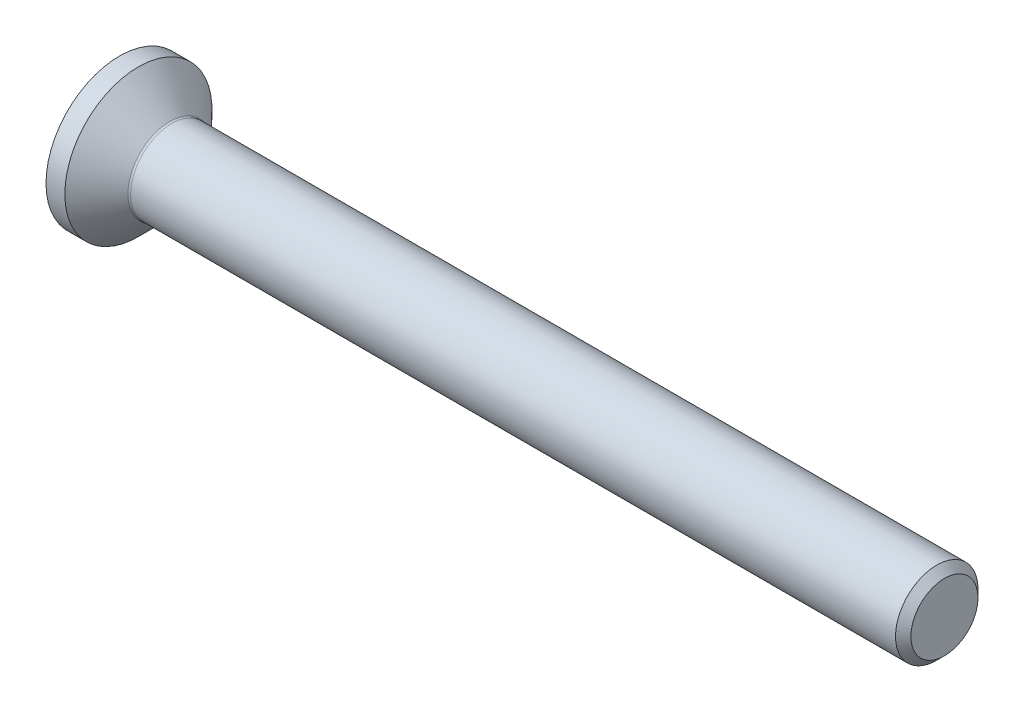
ISO-10303-21;
HEADER;
FILE_DESCRIPTION(('STEP AP214'),'2;1');
FILE_NAME('part.step','',(''),(''),'','','');
FILE_SCHEMA(('AUTOMOTIVE_DESIGN { 1 0 10303 214 1 1 1 1 }'));
ENDSEC;
DATA;
#1=APPLICATION_CONTEXT('core data for automotive mechanical design processes');
#2=APPLICATION_PROTOCOL_DEFINITION('international standard','automotive_design',2000,#1);
#3=PRODUCT_CONTEXT('',#1,'mechanical');
#4=PRODUCT('Part','Part','',(#3));
#5=PRODUCT_RELATED_PRODUCT_CATEGORY('part','',(#4));
#6=PRODUCT_DEFINITION_FORMATION('','',#4);
#7=PRODUCT_DEFINITION_CONTEXT('part definition',#1,'design');
#8=PRODUCT_DEFINITION('design','',#6,#7);
#9=PRODUCT_DEFINITION_SHAPE('','',#8);
#10=(LENGTH_UNIT() NAMED_UNIT(*) SI_UNIT(.MILLI.,.METRE.));
#11=(NAMED_UNIT(*) PLANE_ANGLE_UNIT() SI_UNIT($,.RADIAN.));
#12=(NAMED_UNIT(*) SI_UNIT($,.STERADIAN.) SOLID_ANGLE_UNIT());
#13=UNCERTAINTY_MEASURE_WITH_UNIT(LENGTH_MEASURE(1.E-05),#10,'distance_accuracy_value','');
#14=(GEOMETRIC_REPRESENTATION_CONTEXT(3) GLOBAL_UNCERTAINTY_ASSIGNED_CONTEXT((#13)) GLOBAL_UNIT_ASSIGNED_CONTEXT((#10,
#11,#12)) REPRESENTATION_CONTEXT('',''));
#15=CARTESIAN_POINT('',(0.,0.,0.));
#16=DIRECTION('',(0.,0.,1.));
#17=DIRECTION('',(1.,0.,0.));
#18=AXIS2_PLACEMENT_3D('',#15,#16,#17);
#19=CARTESIAN_POINT('',(0.,0.,0.));
#20=DIRECTION('',(-1.,0.,0.));
#21=DIRECTION('',(0.,0.,1.));
#22=AXIS2_PLACEMENT_3D('',#19,#20,#21);
#23=PLANE('',#22);
#24=CARTESIAN_POINT('',(0.,0.,0.));
#25=DIRECTION('',(-1.,0.,0.));
#26=DIRECTION('',(0.,0.,1.));
#27=AXIS2_PLACEMENT_3D('',#24,#25,#26);
#28=CIRCLE('',#27,2.675);
#29=CARTESIAN_POINT('',(0.,0.,2.675));
#30=VERTEX_POINT('',#29);
#31=EDGE_CURVE('E155',#30,#30,#28,.T.);
#32=ORIENTED_EDGE('',*,*,#31,.T.);
#33=EDGE_LOOP('',(#32));
#34=FACE_BOUND('',#33,.T.);
#35=DIRECTION('',(0.,-0.499999999999998,-0.86602540378444));
#36=VECTOR('',#35,1.);
#37=CARTESIAN_POINT('',(0.,-0.577350269189626,1.));
#38=LINE('',#37,#36);
#39=CARTESIAN_POINT('',(0.,-0.577350269189626,1.));
#40=VERTEX_POINT('',#39);
#41=CARTESIAN_POINT('',(0.,-1.15470053837925,0.));
#42=VERTEX_POINT('',#41);
#43=EDGE_CURVE('E121',#40,#42,#38,.T.);
#44=ORIENTED_EDGE('',*,*,#43,.T.);
#45=DIRECTION('',(0.,0.499999999999999,-0.866025403784439));
#46=VECTOR('',#45,1.);
#47=CARTESIAN_POINT('',(0.,-1.15470053837925,0.));
#48=LINE('',#47,#46);
#49=CARTESIAN_POINT('',(0.,-0.577350269189625,-1.));
#50=VERTEX_POINT('',#49);
#51=EDGE_CURVE('E52',#42,#50,#48,.T.);
#52=ORIENTED_EDGE('',*,*,#51,.T.);
#53=DIRECTION('',(0.,1.,0.));
#54=VECTOR('',#53,1.);
#55=CARTESIAN_POINT('',(0.,-0.577350269189625,-1.));
#56=LINE('',#55,#54);
#57=CARTESIAN_POINT('',(0.,0.577350269189626,-1.));
#58=VERTEX_POINT('',#57);
#59=EDGE_CURVE('E132',#50,#58,#56,.T.);
#60=ORIENTED_EDGE('',*,*,#59,.T.);
#61=DIRECTION('',(0.,0.5,0.866025403784439));
#62=VECTOR('',#61,1.);
#63=CARTESIAN_POINT('',(0.,0.577350269189626,-1.));
#64=LINE('',#63,#62);
#65=CARTESIAN_POINT('',(0.,1.15470053837925,0.));
#66=VERTEX_POINT('',#65);
#67=EDGE_CURVE('E256',#58,#66,#64,.T.);
#68=ORIENTED_EDGE('',*,*,#67,.T.);
#69=DIRECTION('',(0.,-0.499999999999999,0.866025403784439));
#70=VECTOR('',#69,1.);
#71=CARTESIAN_POINT('',(0.,1.15470053837925,0.));
#72=LINE('',#71,#70);
#73=CARTESIAN_POINT('',(0.,0.577350269189626,0.999999999999999));
#74=VERTEX_POINT('',#73);
#75=EDGE_CURVE('E259',#66,#74,#72,.T.);
#76=ORIENTED_EDGE('',*,*,#75,.T.);
#77=DIRECTION('',(0.,-1.,0.));
#78=VECTOR('',#77,1.);
#79=CARTESIAN_POINT('',(0.,0.577350269189626,0.999999999999999));
#80=LINE('',#79,#78);
#81=EDGE_CURVE('E262',#74,#40,#80,.T.);
#82=ORIENTED_EDGE('',*,*,#81,.T.);
#83=EDGE_LOOP('',(#44,#52,#60,#68,#76,#82));
#84=FACE_BOUND('',#83,.T.);
#85=ADVANCED_FACE('F37',(#34,#84),#23,.T.);
#86=CARTESIAN_POINT('',(0.,0.,0.));
#87=DIRECTION('',(-1.,0.,0.));
#88=DIRECTION('',(0.,0.,1.));
#89=AXIS2_PLACEMENT_3D('',#86,#87,#88);
#90=CYLINDRICAL_SURFACE('',#89,2.675);
#91=CARTESIAN_POINT('',(0.685000000000012,0.,0.));
#92=DIRECTION('',(-1.,0.,0.));
#93=DIRECTION('',(0.,0.,1.));
#94=AXIS2_PLACEMENT_3D('',#91,#92,#93);
#95=CIRCLE('',#94,2.675);
#96=CARTESIAN_POINT('',(0.685000000000012,0.,2.675));
#97=VERTEX_POINT('',#96);
#98=EDGE_CURVE('E152',#97,#97,#95,.T.);
#99=ORIENTED_EDGE('',*,*,#98,.T.);
#100=EDGE_LOOP('',(#99));
#101=FACE_BOUND('',#100,.T.);
#102=ORIENTED_EDGE('',*,*,#31,.F.);
#103=EDGE_LOOP('',(#102));
#104=FACE_BOUND('',#103,.T.);
#105=ADVANCED_FACE('F176',(#101,#104),#90,.T.);
#106=CARTESIAN_POINT('',(0.685000000000012,0.,0.));
#107=DIRECTION('',(-1.,0.,0.));
#108=DIRECTION('',(0.,0.,1.));
#109=AXIS2_PLACEMENT_3D('',#106,#107,#108);
#110=CONICAL_SURFACE('',#109,2.675,0.785398163397451);
#111=CARTESIAN_POINT('',(1.83071067811867,0.,0.));
#112=DIRECTION('',(-1.,0.,0.));
#113=DIRECTION('',(0.,0.,1.));
#114=AXIS2_PLACEMENT_3D('',#111,#112,#113);
#115=CIRCLE('',#114,1.52928932188133);
#116=CARTESIAN_POINT('',(1.83071067811867,0.,1.52928932188133));
#117=VERTEX_POINT('',#116);
#118=EDGE_CURVE('E45',#117,#117,#115,.T.);
#119=ORIENTED_EDGE('',*,*,#118,.T.);
#120=EDGE_LOOP('',(#119));
#121=FACE_BOUND('',#120,.T.);
#122=ORIENTED_EDGE('',*,*,#98,.F.);
#123=EDGE_LOOP('',(#122));
#124=FACE_BOUND('',#123,.T.);
#125=ADVANCED_FACE('F160',(#121,#124),#110,.T.);
#126=CARTESIAN_POINT('',(0.,0.,0.));
#127=DIRECTION('',(-1.,0.,0.));
#128=DIRECTION('',(0.,0.,1.));
#129=AXIS2_PLACEMENT_3D('',#126,#127,#128);
#130=CYLINDRICAL_SURFACE('',#129,1.49999999999999);
#131=CARTESIAN_POINT('',(1.90142135623733,0.,0.));
#132=DIRECTION('',(-1.,0.,0.));
#133=DIRECTION('',(0.,0.,1.));
#134=AXIS2_PLACEMENT_3D('',#131,#132,#133);
#135=CIRCLE('',#134,1.49999999999999);
#136=CARTESIAN_POINT('',(1.90142135623733,0.,1.49999999999999));
#137=VERTEX_POINT('',#136);
#138=EDGE_CURVE('E11',#137,#137,#135,.F.);
#139=ORIENTED_EDGE('',*,*,#138,.T.);
#140=EDGE_LOOP('',(#139));
#141=FACE_BOUND('',#140,.T.);
#142=CARTESIAN_POINT('',(29.7195,0.,0.));
#143=DIRECTION('',(-1.,0.,0.));
#144=DIRECTION('',(0.,0.,1.));
#145=AXIS2_PLACEMENT_3D('',#142,#143,#144);
#146=CIRCLE('',#145,1.49999999999997);
#147=CARTESIAN_POINT('',(29.7195,0.,1.49999999999997));
#148=VERTEX_POINT('',#147);
#149=EDGE_CURVE('E149',#148,#148,#146,.T.);
#150=ORIENTED_EDGE('',*,*,#149,.T.);
#151=EDGE_LOOP('',(#150));
#152=FACE_BOUND('',#151,.T.);
#153=ADVANCED_FACE('F187',(#141,#152),#130,.T.);
#154=CARTESIAN_POINT('',(30.,0.,0.));
#155=DIRECTION('',(-1.,0.,0.));
#156=DIRECTION('',(0.,0.,1.));
#157=AXIS2_PLACEMENT_3D('',#154,#155,#156);
#158=CONICAL_SURFACE('',#157,1.2195,0.785398163397374);
#159=ORIENTED_EDGE('',*,*,#149,.F.);
#160=EDGE_LOOP('',(#159));
#161=FACE_BOUND('',#160,.T.);
#162=CARTESIAN_POINT('',(30.,0.,0.));
#163=DIRECTION('',(-1.,0.,0.));
#164=DIRECTION('',(0.,0.,1.));
#165=AXIS2_PLACEMENT_3D('',#162,#163,#164);
#166=CIRCLE('',#165,1.2195);
#167=CARTESIAN_POINT('',(30.,0.,1.2195));
#168=VERTEX_POINT('',#167);
#169=EDGE_CURVE('E145',#168,#168,#166,.T.);
#170=ORIENTED_EDGE('',*,*,#169,.T.);
#171=EDGE_LOOP('',(#170));
#172=FACE_BOUND('',#171,.T.);
#173=ADVANCED_FACE('F171',(#161,#172),#158,.T.);
#174=CARTESIAN_POINT('',(30.,1.2195,0.));
#175=DIRECTION('',(1.,0.,0.));
#176=DIRECTION('',(0.,0.,-1.));
#177=AXIS2_PLACEMENT_3D('',#174,#175,#176);
#178=PLANE('',#177);
#179=ORIENTED_EDGE('',*,*,#169,.F.);
#180=EDGE_LOOP('',(#179));
#181=FACE_BOUND('',#180,.T.);
#182=ADVANCED_FACE('F164',(#181),#178,.T.);
#183=CARTESIAN_POINT('',(1.90142135623733,0.,0.));
#184=DIRECTION('',(-1.,0.,0.));
#185=DIRECTION('',(0.,0.,1.));
#186=AXIS2_PLACEMENT_3D('',#183,#184,#185);
#187=TOROIDAL_SURFACE('',#186,1.59999999999999,0.1);
#188=ORIENTED_EDGE('',*,*,#138,.F.);
#189=EDGE_LOOP('',(#188));
#190=FACE_BOUND('',#189,.T.);
#191=ORIENTED_EDGE('',*,*,#118,.F.);
#192=EDGE_LOOP('',(#191));
#193=FACE_BOUND('',#192,.T.);
#194=ADVANCED_FACE('F39',(#190,#193),#187,.F.);
#195=CARTESIAN_POINT('',(1.1,-1.15470053837925,0.));
#196=DIRECTION('',(0.,0.866025403784439,0.499999999999999));
#197=DIRECTION('',(0.,-0.499999999999999,0.866025403784439));
#198=AXIS2_PLACEMENT_3D('',#195,#196,#197);
#199=PLANE('',#198);
#200=ORIENTED_EDGE('',*,*,#51,.F.);
#201=DIRECTION('',(-1.,0.,0.));
#202=VECTOR('',#201,1.);
#203=CARTESIAN_POINT('',(1.1,-1.15470053837925,0.));
#204=LINE('',#203,#202);
#205=CARTESIAN_POINT('',(1.1,-1.15470053837925,0.));
#206=VERTEX_POINT('',#205);
#207=EDGE_CURVE('E253',#206,#42,#204,.T.);
#208=ORIENTED_EDGE('',*,*,#207,.F.);
#209=DIRECTION('',(0.,0.499999999999999,-0.866025403784439));
#210=VECTOR('',#209,1.);
#211=CARTESIAN_POINT('',(1.1,-1.15470053837925,0.));
#212=LINE('',#211,#210);
#213=CARTESIAN_POINT('',(1.1,-0.866025403784438,-0.499999999999998));
#214=VERTEX_POINT('',#213);
#215=EDGE_CURVE('E117',#206,#214,#212,.T.);
#216=ORIENTED_EDGE('',*,*,#215,.T.);
#217=CARTESIAN_POINT('',(1.1,-0.577350269189625,-1.));
#218=VERTEX_POINT('',#217);
#219=EDGE_CURVE('E113',#214,#218,#212,.T.);
#220=ORIENTED_EDGE('',*,*,#219,.T.);
#221=DIRECTION('',(-1.,0.,0.));
#222=VECTOR('',#221,1.);
#223=CARTESIAN_POINT('',(1.1,-0.577350269189625,-1.));
#224=LINE('',#223,#222);
#225=EDGE_CURVE('E115',#218,#50,#224,.T.);
#226=ORIENTED_EDGE('',*,*,#225,.T.);
#227=EDGE_LOOP('',(#200,#208,#216,#220,#226));
#228=FACE_BOUND('',#227,.T.);
#229=ADVANCED_FACE('F114',(#228),#199,.T.);
#230=CARTESIAN_POINT('',(1.1,-0.577350269189625,-1.));
#231=DIRECTION('',(0.,0.,1.));
#232=DIRECTION('',(1.,0.,0.));
#233=AXIS2_PLACEMENT_3D('',#230,#231,#232);
#234=PLANE('',#233);
#235=ORIENTED_EDGE('',*,*,#59,.F.);
#236=ORIENTED_EDGE('',*,*,#225,.F.);
#237=DIRECTION('',(0.,1.,0.));
#238=VECTOR('',#237,1.);
#239=CARTESIAN_POINT('',(1.1,-0.577350269189625,-1.));
#240=LINE('',#239,#238);
#241=CARTESIAN_POINT('',(1.1,0.,-1.));
#242=VERTEX_POINT('',#241);
#243=EDGE_CURVE('E60',#218,#242,#240,.T.);
#244=ORIENTED_EDGE('',*,*,#243,.T.);
#245=CARTESIAN_POINT('',(1.1,0.577350269189626,-1.));
#246=VERTEX_POINT('',#245);
#247=EDGE_CURVE('E127',#242,#246,#240,.T.);
#248=ORIENTED_EDGE('',*,*,#247,.T.);
#249=DIRECTION('',(-1.,0.,0.));
#250=VECTOR('',#249,1.);
#251=CARTESIAN_POINT('',(1.1,0.577350269189626,-1.));
#252=LINE('',#251,#250);
#253=EDGE_CURVE('E134',#246,#58,#252,.T.);
#254=ORIENTED_EDGE('',*,*,#253,.T.);
#255=EDGE_LOOP('',(#235,#236,#244,#248,#254));
#256=FACE_BOUND('',#255,.T.);
#257=ADVANCED_FACE('F129',(#256),#234,.T.);
#258=CARTESIAN_POINT('',(1.1,0.577350269189626,-1.));
#259=DIRECTION('',(0.,-0.866025403784438,0.5));
#260=DIRECTION('',(0.,-0.5,-0.866025403784439));
#261=AXIS2_PLACEMENT_3D('',#258,#259,#260);
#262=PLANE('',#261);
#263=ORIENTED_EDGE('',*,*,#67,.F.);
#264=ORIENTED_EDGE('',*,*,#253,.F.);
#265=DIRECTION('',(0.,0.5,0.866025403784439));
#266=VECTOR('',#265,1.);
#267=CARTESIAN_POINT('',(1.1,0.577350269189626,-1.));
#268=LINE('',#267,#266);
#269=CARTESIAN_POINT('',(1.1,0.866025403784439,-0.5));
#270=VERTEX_POINT('',#269);
#271=EDGE_CURVE('E234',#246,#270,#268,.T.);
#272=ORIENTED_EDGE('',*,*,#271,.T.);
#273=CARTESIAN_POINT('',(1.1,1.15470053837925,0.));
#274=VERTEX_POINT('',#273);
#275=EDGE_CURVE('E126',#270,#274,#268,.T.);
#276=ORIENTED_EDGE('',*,*,#275,.T.);
#277=DIRECTION('',(-1.,0.,0.));
#278=VECTOR('',#277,1.);
#279=CARTESIAN_POINT('',(1.1,1.15470053837925,0.));
#280=LINE('',#279,#278);
#281=EDGE_CURVE('E140',#274,#66,#280,.T.);
#282=ORIENTED_EDGE('',*,*,#281,.T.);
#283=EDGE_LOOP('',(#263,#264,#272,#276,#282));
#284=FACE_BOUND('',#283,.T.);
#285=ADVANCED_FACE('F201',(#284),#262,.T.);
#286=CARTESIAN_POINT('',(1.1,1.15470053837925,0.));
#287=DIRECTION('',(0.,-0.866025403784439,-0.499999999999999));
#288=DIRECTION('',(0.,0.499999999999999,-0.866025403784439));
#289=AXIS2_PLACEMENT_3D('',#286,#287,#288);
#290=PLANE('',#289);
#291=ORIENTED_EDGE('',*,*,#75,.F.);
#292=ORIENTED_EDGE('',*,*,#281,.F.);
#293=DIRECTION('',(0.,-0.499999999999999,0.866025403784439));
#294=VECTOR('',#293,1.);
#295=CARTESIAN_POINT('',(1.1,1.15470053837925,0.));
#296=LINE('',#295,#294);
#297=CARTESIAN_POINT('',(1.1,0.866025403784438,0.499999999999999));
#298=VERTEX_POINT('',#297);
#299=EDGE_CURVE('E241',#274,#298,#296,.T.);
#300=ORIENTED_EDGE('',*,*,#299,.T.);
#301=CARTESIAN_POINT('',(1.1,0.577350269189626,0.999999999999999));
#302=VERTEX_POINT('',#301);
#303=EDGE_CURVE('E239',#298,#302,#296,.T.);
#304=ORIENTED_EDGE('',*,*,#303,.T.);
#305=DIRECTION('',(-1.,0.,0.));
#306=VECTOR('',#305,1.);
#307=CARTESIAN_POINT('',(1.1,0.577350269189626,0.999999999999999));
#308=LINE('',#307,#306);
#309=EDGE_CURVE('E271',#302,#74,#308,.T.);
#310=ORIENTED_EDGE('',*,*,#309,.T.);
#311=EDGE_LOOP('',(#291,#292,#300,#304,#310));
#312=FACE_BOUND('',#311,.T.);
#313=ADVANCED_FACE('F204',(#312),#290,.T.);
#314=CARTESIAN_POINT('',(1.1,0.577350269189626,0.999999999999999));
#315=DIRECTION('',(0.,0.,-1.));
#316=DIRECTION('',(0.,1.,0.));
#317=AXIS2_PLACEMENT_3D('',#314,#315,#316);
#318=PLANE('',#317);
#319=ORIENTED_EDGE('',*,*,#81,.F.);
#320=ORIENTED_EDGE('',*,*,#309,.F.);
#321=DIRECTION('',(0.,-1.,0.));
#322=VECTOR('',#321,1.);
#323=CARTESIAN_POINT('',(1.1,0.577350269189626,0.999999999999999));
#324=LINE('',#323,#322);
#325=CARTESIAN_POINT('',(1.1,0.,1.));
#326=VERTEX_POINT('',#325);
#327=EDGE_CURVE('E246',#302,#326,#324,.T.);
#328=ORIENTED_EDGE('',*,*,#327,.T.);
#329=CARTESIAN_POINT('',(1.1,-0.577350269189626,1.));
#330=VERTEX_POINT('',#329);
#331=EDGE_CURVE('E245',#326,#330,#324,.T.);
#332=ORIENTED_EDGE('',*,*,#331,.T.);
#333=DIRECTION('',(-1.,0.,0.));
#334=VECTOR('',#333,1.);
#335=CARTESIAN_POINT('',(1.1,-0.577350269189626,1.));
#336=LINE('',#335,#334);
#337=EDGE_CURVE('E268',#330,#40,#336,.T.);
#338=ORIENTED_EDGE('',*,*,#337,.T.);
#339=EDGE_LOOP('',(#319,#320,#328,#332,#338));
#340=FACE_BOUND('',#339,.T.);
#341=ADVANCED_FACE('F208',(#340),#318,.T.);
#342=CARTESIAN_POINT('',(1.1,-0.577350269189626,1.));
#343=DIRECTION('',(0.,0.86602540378444,-0.499999999999998));
#344=DIRECTION('',(0.,0.499999999999998,0.86602540378444));
#345=AXIS2_PLACEMENT_3D('',#342,#343,#344);
#346=PLANE('',#345);
#347=ORIENTED_EDGE('',*,*,#43,.F.);
#348=ORIENTED_EDGE('',*,*,#337,.F.);
#349=DIRECTION('',(0.,-0.499999999999998,-0.86602540378444));
#350=VECTOR('',#349,1.);
#351=CARTESIAN_POINT('',(1.1,-0.577350269189626,1.));
#352=LINE('',#351,#350);
#353=CARTESIAN_POINT('',(1.1,-0.866025403784439,0.499999999999997));
#354=VERTEX_POINT('',#353);
#355=EDGE_CURVE('E250',#330,#354,#352,.T.);
#356=ORIENTED_EDGE('',*,*,#355,.T.);
#357=EDGE_CURVE('E249',#354,#206,#352,.T.);
#358=ORIENTED_EDGE('',*,*,#357,.T.);
#359=ORIENTED_EDGE('',*,*,#207,.T.);
#360=EDGE_LOOP('',(#347,#348,#356,#358,#359));
#361=FACE_BOUND('',#360,.T.);
#362=ADVANCED_FACE('F212',(#361),#346,.T.);
#363=CARTESIAN_POINT('',(1.1,-0.577350269189626,-1.));
#364=DIRECTION('',(1.,0.,0.));
#365=DIRECTION('',(0.,0.,-1.));
#366=AXIS2_PLACEMENT_3D('',#363,#364,#365);
#367=PLANE('',#366);
#368=ORIENTED_EDGE('',*,*,#243,.F.);
#369=ORIENTED_EDGE('',*,*,#219,.F.);
#370=CARTESIAN_POINT('',(1.1,0.,0.));
#371=DIRECTION('',(-1.,0.,0.));
#372=DIRECTION('',(0.,0.,1.));
#373=AXIS2_PLACEMENT_3D('',#370,#371,#372);
#374=CIRCLE('',#373,1.);
#375=EDGE_CURVE('E124',#242,#214,#374,.T.);
#376=ORIENTED_EDGE('',*,*,#375,.F.);
#377=EDGE_LOOP('',(#368,#369,#376));
#378=FACE_BOUND('',#377,.T.);
#379=ADVANCED_FACE('F123',(#378),#367,.F.);
#380=ORIENTED_EDGE('',*,*,#215,.F.);
#381=ORIENTED_EDGE('',*,*,#357,.F.);
#382=EDGE_CURVE('E137',#214,#354,#374,.T.);
#383=ORIENTED_EDGE('',*,*,#382,.F.);
#384=EDGE_LOOP('',(#380,#381,#383));
#385=FACE_BOUND('',#384,.T.);
#386=ADVANCED_FACE('F218',(#385),#367,.F.);
#387=ORIENTED_EDGE('',*,*,#355,.F.);
#388=ORIENTED_EDGE('',*,*,#331,.F.);
#389=EDGE_CURVE('E133',#354,#326,#374,.T.);
#390=ORIENTED_EDGE('',*,*,#389,.F.);
#391=EDGE_LOOP('',(#387,#388,#390));
#392=FACE_BOUND('',#391,.T.);
#393=ADVANCED_FACE('F222',(#392),#367,.F.);
#394=ORIENTED_EDGE('',*,*,#327,.F.);
#395=ORIENTED_EDGE('',*,*,#303,.F.);
#396=EDGE_CURVE('E139',#326,#298,#374,.T.);
#397=ORIENTED_EDGE('',*,*,#396,.F.);
#398=EDGE_LOOP('',(#394,#395,#397));
#399=FACE_BOUND('',#398,.T.);
#400=ADVANCED_FACE('F230',(#399),#367,.F.);
#401=ORIENTED_EDGE('',*,*,#299,.F.);
#402=ORIENTED_EDGE('',*,*,#275,.F.);
#403=EDGE_CURVE('E146',#298,#270,#374,.T.);
#404=ORIENTED_EDGE('',*,*,#403,.F.);
#405=EDGE_LOOP('',(#401,#402,#404));
#406=FACE_BOUND('',#405,.T.);
#407=ADVANCED_FACE('F225',(#406),#367,.F.);
#408=ORIENTED_EDGE('',*,*,#271,.F.);
#409=ORIENTED_EDGE('',*,*,#247,.F.);
#410=EDGE_CURVE('E235',#270,#242,#374,.T.);
#411=ORIENTED_EDGE('',*,*,#410,.F.);
#412=EDGE_LOOP('',(#408,#409,#411));
#413=FACE_BOUND('',#412,.T.);
#414=ADVANCED_FACE('F196',(#413),#367,.F.);
#415=CARTESIAN_POINT('',(1.1,0.,0.));
#416=DIRECTION('',(-1.,0.,0.));
#417=DIRECTION('',(0.,0.,1.));
#418=AXIS2_PLACEMENT_3D('',#415,#416,#417);
#419=CONICAL_SURFACE('',#418,1.,1.04719755119659);
#420=CARTESIAN_POINT('',(1.67735026918963,0.,0.));
#421=VERTEX_POINT('',#420);
#422=VERTEX_LOOP('',#421);
#423=FACE_BOUND('',#422,.T.);
#424=ORIENTED_EDGE('',*,*,#396,.T.);
#425=ORIENTED_EDGE('',*,*,#403,.T.);
#426=ORIENTED_EDGE('',*,*,#410,.T.);
#427=ORIENTED_EDGE('',*,*,#375,.T.);
#428=ORIENTED_EDGE('',*,*,#382,.T.);
#429=ORIENTED_EDGE('',*,*,#389,.T.);
#430=EDGE_LOOP('',(#424,#425,#426,#427,#428,#429));
#431=FACE_BOUND('',#430,.T.);
#432=ADVANCED_FACE('F194',(#423,#431),#419,.F.);
#433=CLOSED_SHELL('',(#85,#105,#125,#153,#173,#182,#194,#229,#257,#285,#313,#341,#362,#379,#386,
#393,#400,#407,#414,#432));
#434=MANIFOLD_SOLID_BREP('B2',#433);
#435=ADVANCED_BREP_SHAPE_REPRESENTATION('',(#18,#434),#14);
#436=SHAPE_DEFINITION_REPRESENTATION(#9,#435);
ENDSEC;
END-ISO-10303-21;
